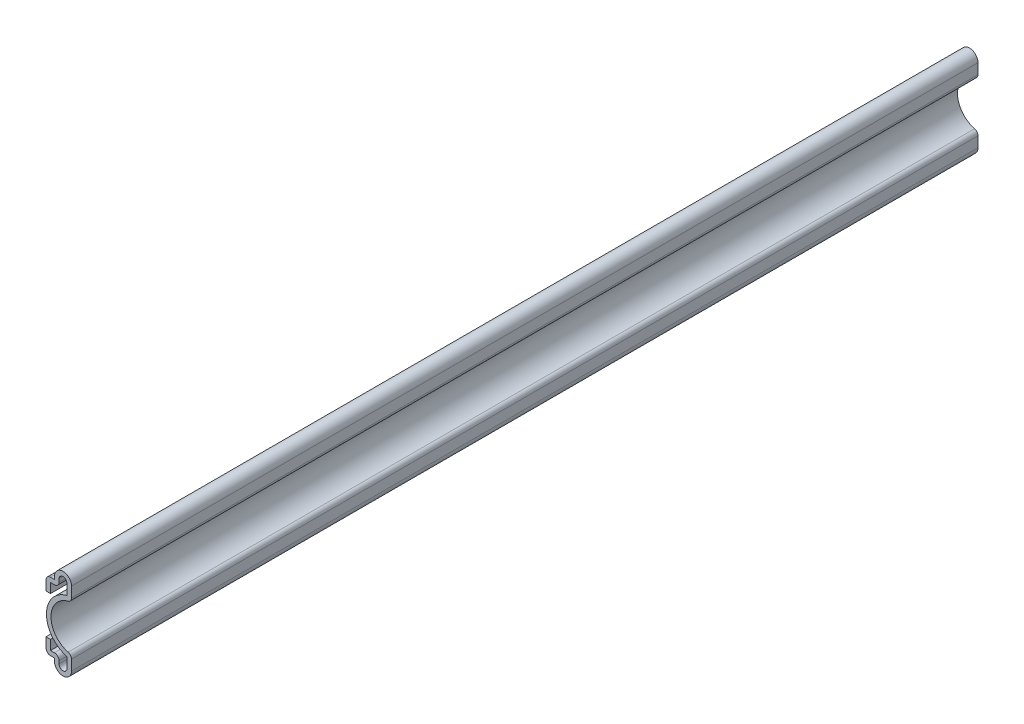
ISO-10303-21;
HEADER;
FILE_DESCRIPTION(('STEP AP214'),'2;1');
FILE_NAME('part.step','',(''),(''),'','','');
FILE_SCHEMA(('AUTOMOTIVE_DESIGN { 1 0 10303 214 1 1 1 1 }'));
ENDSEC;
DATA;
#1=APPLICATION_CONTEXT('core data for automotive mechanical design processes');
#2=APPLICATION_PROTOCOL_DEFINITION('international standard','automotive_design',2000,#1);
#3=PRODUCT_CONTEXT('',#1,'mechanical');
#4=PRODUCT('Part','Part','',(#3));
#5=PRODUCT_RELATED_PRODUCT_CATEGORY('part','',(#4));
#6=PRODUCT_DEFINITION_FORMATION('','',#4);
#7=PRODUCT_DEFINITION_CONTEXT('part definition',#1,'design');
#8=PRODUCT_DEFINITION('design','',#6,#7);
#9=PRODUCT_DEFINITION_SHAPE('','',#8);
#10=(LENGTH_UNIT() NAMED_UNIT(*) SI_UNIT(.MILLI.,.METRE.));
#11=(NAMED_UNIT(*) PLANE_ANGLE_UNIT() SI_UNIT($,.RADIAN.));
#12=(NAMED_UNIT(*) SI_UNIT($,.STERADIAN.) SOLID_ANGLE_UNIT());
#13=UNCERTAINTY_MEASURE_WITH_UNIT(LENGTH_MEASURE(1.E-05),#10,'distance_accuracy_value','');
#14=(GEOMETRIC_REPRESENTATION_CONTEXT(3) GLOBAL_UNCERTAINTY_ASSIGNED_CONTEXT((#13)) GLOBAL_UNIT_ASSIGNED_CONTEXT((#10,
#11,#12)) REPRESENTATION_CONTEXT('',''));
#15=CARTESIAN_POINT('',(0.,0.,0.));
#16=DIRECTION('',(0.,0.,1.));
#17=DIRECTION('',(1.,0.,0.));
#18=AXIS2_PLACEMENT_3D('',#15,#16,#17);
#19=CARTESIAN_POINT('',(-5.87375,7.14375,-254.));
#20=DIRECTION('',(1.,0.,0.));
#21=DIRECTION('',(0.,1.,0.));
#22=AXIS2_PLACEMENT_3D('',#19,#20,#21);
#23=PLANE('',#22);
#24=DIRECTION('',(0.,1.,0.));
#25=VECTOR('',#24,1.);
#26=CARTESIAN_POINT('',(-5.87375,7.14375,0.));
#27=LINE('',#26,#25);
#28=CARTESIAN_POINT('',(-5.87375,4.445,0.));
#29=VERTEX_POINT('',#28);
#30=CARTESIAN_POINT('',(-5.87375,7.14375,0.));
#31=VERTEX_POINT('',#30);
#32=EDGE_CURVE('E315',#29,#31,#27,.T.);
#33=ORIENTED_EDGE('',*,*,#32,.F.);
#34=DIRECTION('',(0.,0.,1.));
#35=VECTOR('',#34,1.);
#36=CARTESIAN_POINT('',(-5.87375,4.445,-254.));
#37=LINE('',#36,#35);
#38=CARTESIAN_POINT('',(-5.87375,4.445,-254.));
#39=VERTEX_POINT('',#38);
#40=EDGE_CURVE('E257',#39,#29,#37,.T.);
#41=ORIENTED_EDGE('',*,*,#40,.F.);
#42=DIRECTION('',(0.,1.,0.));
#43=VECTOR('',#42,1.);
#44=CARTESIAN_POINT('',(-5.87375,7.14375,-254.));
#45=LINE('',#44,#43);
#46=CARTESIAN_POINT('',(-5.87375,7.14375,-254.));
#47=VERTEX_POINT('',#46);
#48=EDGE_CURVE('E238',#39,#47,#45,.T.);
#49=ORIENTED_EDGE('',*,*,#48,.T.);
#50=DIRECTION('',(0.,0.,1.));
#51=VECTOR('',#50,1.);
#52=CARTESIAN_POINT('',(-5.87375,7.14375,-254.));
#53=LINE('',#52,#51);
#54=EDGE_CURVE('E245',#47,#31,#53,.T.);
#55=ORIENTED_EDGE('',*,*,#54,.T.);
#56=EDGE_LOOP('',(#33,#41,#49,#55));
#57=FACE_BOUND('',#56,.T.);
#58=ADVANCED_FACE('F35',(#57),#23,.T.);
#59=CARTESIAN_POINT('',(-7.14375,4.445,-254.));
#60=DIRECTION('',(0.,1.,0.));
#61=DIRECTION('',(-1.,0.,0.));
#62=AXIS2_PLACEMENT_3D('',#59,#60,#61);
#63=PLANE('',#62);
#64=DIRECTION('',(-1.,0.,0.));
#65=VECTOR('',#64,1.);
#66=CARTESIAN_POINT('',(-7.14375,4.445,0.));
#67=LINE('',#66,#65);
#68=CARTESIAN_POINT('',(-4.7625,4.445,0.));
#69=VERTEX_POINT('',#68);
#70=EDGE_CURVE('E258',#69,#29,#67,.T.);
#71=ORIENTED_EDGE('',*,*,#70,.F.);
#72=DIRECTION('',(0.,0.,1.));
#73=VECTOR('',#72,1.);
#74=CARTESIAN_POINT('',(-4.7625,4.445,-254.));
#75=LINE('',#74,#73);
#76=CARTESIAN_POINT('',(-4.7625,4.445,-254.));
#77=VERTEX_POINT('',#76);
#78=EDGE_CURVE('E450',#69,#77,#75,.F.);
#79=ORIENTED_EDGE('',*,*,#78,.T.);
#80=DIRECTION('',(-1.,0.,0.));
#81=VECTOR('',#80,1.);
#82=CARTESIAN_POINT('',(-7.14375,4.445,-254.));
#83=LINE('',#82,#81);
#84=EDGE_CURVE('E253',#77,#39,#83,.T.);
#85=ORIENTED_EDGE('',*,*,#84,.T.);
#86=ORIENTED_EDGE('',*,*,#40,.T.);
#87=EDGE_LOOP('',(#71,#79,#85,#86));
#88=FACE_BOUND('',#87,.T.);
#89=ADVANCED_FACE('F539',(#88),#63,.T.);
#90=CARTESIAN_POINT('',(-3.4925,3.17500000000001,-254.));
#91=DIRECTION('',(1.,0.,0.));
#92=DIRECTION('',(0.,1.,0.));
#93=AXIS2_PLACEMENT_3D('',#90,#91,#92);
#94=PLANE('',#93);
#95=DIRECTION('',(0.,1.,0.));
#96=VECTOR('',#95,1.);
#97=CARTESIAN_POINT('',(-3.4925,3.17500000000001,-254.));
#98=LINE('',#97,#96);
#99=CARTESIAN_POINT('',(-3.4925,2.38125000000001,-254.));
#100=VERTEX_POINT('',#99);
#101=CARTESIAN_POINT('',(-3.4925,3.17500000000001,-254.));
#102=VERTEX_POINT('',#101);
#103=EDGE_CURVE('E311',#100,#102,#98,.T.);
#104=ORIENTED_EDGE('',*,*,#103,.T.);
#105=DIRECTION('',(0.,0.,1.));
#106=VECTOR('',#105,1.);
#107=CARTESIAN_POINT('',(-3.4925,3.17500000000001,-254.));
#108=LINE('',#107,#106);
#109=CARTESIAN_POINT('',(-3.4925,3.17500000000001,0.));
#110=VERTEX_POINT('',#109);
#111=EDGE_CURVE('E447',#102,#110,#108,.T.);
#112=ORIENTED_EDGE('',*,*,#111,.T.);
#113=DIRECTION('',(0.,1.,0.));
#114=VECTOR('',#113,1.);
#115=CARTESIAN_POINT('',(-3.4925,3.17500000000001,0.));
#116=LINE('',#115,#114);
#117=CARTESIAN_POINT('',(-3.4925,2.38125000000001,0.));
#118=VERTEX_POINT('',#117);
#119=EDGE_CURVE('E260',#118,#110,#116,.T.);
#120=ORIENTED_EDGE('',*,*,#119,.F.);
#121=DIRECTION('',(0.,0.,1.));
#122=VECTOR('',#121,1.);
#123=CARTESIAN_POINT('',(-3.4925,2.38125000000001,-254.));
#124=LINE('',#123,#122);
#125=EDGE_CURVE('E372',#100,#118,#124,.T.);
#126=ORIENTED_EDGE('',*,*,#125,.F.);
#127=EDGE_LOOP('',(#104,#112,#120,#126));
#128=FACE_BOUND('',#127,.T.);
#129=ADVANCED_FACE('F531',(#128),#94,.T.);
#130=CARTESIAN_POINT('',(-2.38125,2.38125,-254.));
#131=DIRECTION('',(0.,0.,1.));
#132=DIRECTION('',(1.,0.,0.));
#133=AXIS2_PLACEMENT_3D('',#130,#131,#132);
#134=CYLINDRICAL_SURFACE('',#133,1.11125);
#135=CARTESIAN_POINT('',(-2.38125,2.38125,0.));
#136=DIRECTION('',(0.,0.,1.));
#137=DIRECTION('',(1.,0.,0.));
#138=AXIS2_PLACEMENT_3D('',#135,#136,#137);
#139=CIRCLE('',#138,1.11125);
#140=CARTESIAN_POINT('',(-1.27,2.38125,0.));
#141=VERTEX_POINT('',#140);
#142=EDGE_CURVE('E365',#141,#118,#139,.F.);
#143=ORIENTED_EDGE('',*,*,#142,.F.);
#144=DIRECTION('',(0.,0.,1.));
#145=VECTOR('',#144,1.);
#146=CARTESIAN_POINT('',(-1.27,2.38125,-254.));
#147=LINE('',#146,#145);
#148=CARTESIAN_POINT('',(-1.27,2.38125,-254.));
#149=VERTEX_POINT('',#148);
#150=EDGE_CURVE('E374',#149,#141,#147,.T.);
#151=ORIENTED_EDGE('',*,*,#150,.F.);
#152=CARTESIAN_POINT('',(-2.38125,2.38125,-254.));
#153=DIRECTION('',(0.,0.,1.));
#154=DIRECTION('',(1.,0.,0.));
#155=AXIS2_PLACEMENT_3D('',#152,#153,#154);
#156=CIRCLE('',#155,1.11125);
#157=EDGE_CURVE('E308',#149,#100,#156,.F.);
#158=ORIENTED_EDGE('',*,*,#157,.T.);
#159=ORIENTED_EDGE('',*,*,#125,.T.);
#160=EDGE_LOOP('',(#143,#151,#158,#159));
#161=FACE_BOUND('',#160,.T.);
#162=ADVANCED_FACE('F527',(#161),#134,.F.);
#163=CARTESIAN_POINT('',(-1.27,2.38125,-254.));
#164=DIRECTION('',(-1.,0.,0.));
#165=DIRECTION('',(0.,0.,1.));
#166=AXIS2_PLACEMENT_3D('',#163,#164,#165);
#167=PLANE('',#166);
#168=DIRECTION('',(0.,1.,0.));
#169=VECTOR('',#168,1.);
#170=CARTESIAN_POINT('',(-1.27,2.38125,0.));
#171=LINE('',#170,#169);
#172=CARTESIAN_POINT('',(-1.27,5.28924801386526,0.));
#173=VERTEX_POINT('',#172);
#174=EDGE_CURVE('E362',#173,#141,#171,.F.);
#175=ORIENTED_EDGE('',*,*,#174,.F.);
#176=DIRECTION('',(0.,0.,1.));
#177=VECTOR('',#176,1.);
#178=CARTESIAN_POINT('',(-1.27,5.28924801386526,-254.));
#179=LINE('',#178,#177);
#180=CARTESIAN_POINT('',(-1.27,5.28924801386526,-254.));
#181=VERTEX_POINT('',#180);
#182=EDGE_CURVE('E376',#181,#173,#179,.T.);
#183=ORIENTED_EDGE('',*,*,#182,.F.);
#184=DIRECTION('',(0.,1.,0.));
#185=VECTOR('',#184,1.);
#186=CARTESIAN_POINT('',(-1.27,2.38125,-254.));
#187=LINE('',#186,#185);
#188=EDGE_CURVE('E305',#181,#149,#187,.F.);
#189=ORIENTED_EDGE('',*,*,#188,.T.);
#190=ORIENTED_EDGE('',*,*,#150,.T.);
#191=EDGE_LOOP('',(#175,#183,#189,#190));
#192=FACE_BOUND('',#191,.T.);
#193=ADVANCED_FACE('F523',(#192),#167,.T.);
#194=CARTESIAN_POINT('',(0.634912292817671,12.7,-254.));
#195=DIRECTION('',(0.,0.,1.));
#196=DIRECTION('',(1.,0.,0.));
#197=AXIS2_PLACEMENT_3D('',#194,#195,#196);
#198=CYLINDRICAL_SURFACE('',#197,7.65166229281768);
#199=CARTESIAN_POINT('',(0.634912292817671,12.7,0.));
#200=DIRECTION('',(0.,0.,1.));
#201=DIRECTION('',(1.,0.,0.));
#202=AXIS2_PLACEMENT_3D('',#199,#200,#201);
#203=CIRCLE('',#202,7.65166229281768);
#204=CARTESIAN_POINT('',(-1.27,20.1107519861347,0.));
#205=VERTEX_POINT('',#204);
#206=EDGE_CURVE('E359',#205,#173,#203,.T.);
#207=ORIENTED_EDGE('',*,*,#206,.F.);
#208=DIRECTION('',(0.,0.,1.));
#209=VECTOR('',#208,1.);
#210=CARTESIAN_POINT('',(-1.27,20.1107519861347,-254.));
#211=LINE('',#210,#209);
#212=CARTESIAN_POINT('',(-1.27,20.1107519861347,-254.));
#213=VERTEX_POINT('',#212);
#214=EDGE_CURVE('E378',#213,#205,#211,.T.);
#215=ORIENTED_EDGE('',*,*,#214,.F.);
#216=CARTESIAN_POINT('',(0.634912292817671,12.7,-254.));
#217=DIRECTION('',(0.,0.,1.));
#218=DIRECTION('',(1.,0.,0.));
#219=AXIS2_PLACEMENT_3D('',#216,#217,#218);
#220=CIRCLE('',#219,7.65166229281768);
#221=EDGE_CURVE('E302',#213,#181,#220,.T.);
#222=ORIENTED_EDGE('',*,*,#221,.T.);
#223=ORIENTED_EDGE('',*,*,#182,.T.);
#224=EDGE_LOOP('',(#207,#215,#222,#223));
#225=FACE_BOUND('',#224,.T.);
#226=ADVANCED_FACE('F519',(#225),#198,.T.);
#227=CARTESIAN_POINT('',(-1.27,23.01875,-254.));
#228=DIRECTION('',(-1.,0.,0.));
#229=DIRECTION('',(0.,0.,1.));
#230=AXIS2_PLACEMENT_3D('',#227,#228,#229);
#231=PLANE('',#230);
#232=DIRECTION('',(0.,1.,0.));
#233=VECTOR('',#232,1.);
#234=CARTESIAN_POINT('',(-1.27,23.01875,0.));
#235=LINE('',#234,#233);
#236=CARTESIAN_POINT('',(-1.27,23.01875,0.));
#237=VERTEX_POINT('',#236);
#238=EDGE_CURVE('E356',#237,#205,#235,.F.);
#239=ORIENTED_EDGE('',*,*,#238,.F.);
#240=DIRECTION('',(0.,0.,1.));
#241=VECTOR('',#240,1.);
#242=CARTESIAN_POINT('',(-1.27,23.01875,-254.));
#243=LINE('',#242,#241);
#244=CARTESIAN_POINT('',(-1.27,23.01875,-254.));
#245=VERTEX_POINT('',#244);
#246=EDGE_CURVE('E380',#245,#237,#243,.T.);
#247=ORIENTED_EDGE('',*,*,#246,.F.);
#248=DIRECTION('',(0.,1.,0.));
#249=VECTOR('',#248,1.);
#250=CARTESIAN_POINT('',(-1.27,23.01875,-254.));
#251=LINE('',#250,#249);
#252=EDGE_CURVE('E299',#245,#213,#251,.F.);
#253=ORIENTED_EDGE('',*,*,#252,.T.);
#254=ORIENTED_EDGE('',*,*,#214,.T.);
#255=EDGE_LOOP('',(#239,#247,#253,#254));
#256=FACE_BOUND('',#255,.T.);
#257=ADVANCED_FACE('F516',(#256),#231,.T.);
#258=CARTESIAN_POINT('',(-2.38125,23.01875,-254.));
#259=DIRECTION('',(0.,0.,1.));
#260=DIRECTION('',(1.,0.,0.));
#261=AXIS2_PLACEMENT_3D('',#258,#259,#260);
#262=CYLINDRICAL_SURFACE('',#261,1.11125);
#263=CARTESIAN_POINT('',(-2.38125,23.01875,0.));
#264=DIRECTION('',(0.,0.,1.));
#265=DIRECTION('',(1.,0.,0.));
#266=AXIS2_PLACEMENT_3D('',#263,#264,#265);
#267=CIRCLE('',#266,1.11125);
#268=CARTESIAN_POINT('',(-3.4925,23.01875,0.));
#269=VERTEX_POINT('',#268);
#270=EDGE_CURVE('E353',#269,#237,#267,.F.);
#271=ORIENTED_EDGE('',*,*,#270,.F.);
#272=DIRECTION('',(0.,0.,1.));
#273=VECTOR('',#272,1.);
#274=CARTESIAN_POINT('',(-3.4925,23.01875,-254.));
#275=LINE('',#274,#273);
#276=CARTESIAN_POINT('',(-3.4925,23.01875,-254.));
#277=VERTEX_POINT('',#276);
#278=EDGE_CURVE('E382',#277,#269,#275,.T.);
#279=ORIENTED_EDGE('',*,*,#278,.F.);
#280=CARTESIAN_POINT('',(-2.38125,23.01875,-254.));
#281=DIRECTION('',(0.,0.,1.));
#282=DIRECTION('',(1.,0.,0.));
#283=AXIS2_PLACEMENT_3D('',#280,#281,#282);
#284=CIRCLE('',#283,1.11125);
#285=EDGE_CURVE('E296',#277,#245,#284,.F.);
#286=ORIENTED_EDGE('',*,*,#285,.T.);
#287=ORIENTED_EDGE('',*,*,#246,.T.);
#288=EDGE_LOOP('',(#271,#279,#286,#287));
#289=FACE_BOUND('',#288,.T.);
#290=ADVANCED_FACE('F512',(#289),#262,.F.);
#291=CARTESIAN_POINT('',(-3.4925,22.225,-254.));
#292=DIRECTION('',(1.,0.,0.));
#293=DIRECTION('',(0.,1.,0.));
#294=AXIS2_PLACEMENT_3D('',#291,#292,#293);
#295=PLANE('',#294);
#296=DIRECTION('',(0.,1.,0.));
#297=VECTOR('',#296,1.);
#298=CARTESIAN_POINT('',(-3.4925,22.225,0.));
#299=LINE('',#298,#297);
#300=CARTESIAN_POINT('',(-3.4925,22.225,0.));
#301=VERTEX_POINT('',#300);
#302=EDGE_CURVE('E351',#301,#269,#299,.T.);
#303=ORIENTED_EDGE('',*,*,#302,.F.);
#304=DIRECTION('',(0.,0.,1.));
#305=VECTOR('',#304,1.);
#306=CARTESIAN_POINT('',(-3.4925,22.225,-254.));
#307=LINE('',#306,#305);
#308=CARTESIAN_POINT('',(-3.4925,22.225,-254.));
#309=VERTEX_POINT('',#308);
#310=EDGE_CURVE('E455',#301,#309,#307,.F.);
#311=ORIENTED_EDGE('',*,*,#310,.T.);
#312=DIRECTION('',(0.,1.,0.));
#313=VECTOR('',#312,1.);
#314=CARTESIAN_POINT('',(-3.4925,22.225,-254.));
#315=LINE('',#314,#313);
#316=EDGE_CURVE('E294',#309,#277,#315,.T.);
#317=ORIENTED_EDGE('',*,*,#316,.T.);
#318=ORIENTED_EDGE('',*,*,#278,.T.);
#319=EDGE_LOOP('',(#303,#311,#317,#318));
#320=FACE_BOUND('',#319,.T.);
#321=ADVANCED_FACE('F503',(#320),#295,.T.);
#322=CARTESIAN_POINT('',(-7.14375,20.955,-254.));
#323=DIRECTION('',(0.,-1.,0.));
#324=DIRECTION('',(0.,0.,-1.));
#325=AXIS2_PLACEMENT_3D('',#322,#323,#324);
#326=PLANE('',#325);
#327=DIRECTION('',(1.,0.,0.));
#328=VECTOR('',#327,1.);
#329=CARTESIAN_POINT('',(-7.14375,20.955,-254.));
#330=LINE('',#329,#328);
#331=CARTESIAN_POINT('',(-5.87375,20.955,-254.));
#332=VERTEX_POINT('',#331);
#333=CARTESIAN_POINT('',(-4.7625,20.955,-254.));
#334=VERTEX_POINT('',#333);
#335=EDGE_CURVE('E291',#332,#334,#330,.T.);
#336=ORIENTED_EDGE('',*,*,#335,.T.);
#337=DIRECTION('',(0.,0.,1.));
#338=VECTOR('',#337,1.);
#339=CARTESIAN_POINT('',(-4.7625,20.955,-254.));
#340=LINE('',#339,#338);
#341=CARTESIAN_POINT('',(-4.7625,20.955,0.));
#342=VERTEX_POINT('',#341);
#343=EDGE_CURVE('E452',#334,#342,#340,.T.);
#344=ORIENTED_EDGE('',*,*,#343,.T.);
#345=DIRECTION('',(1.,0.,0.));
#346=VECTOR('',#345,1.);
#347=CARTESIAN_POINT('',(-7.14375,20.955,0.));
#348=LINE('',#347,#346);
#349=CARTESIAN_POINT('',(-5.87375,20.955,0.));
#350=VERTEX_POINT('',#349);
#351=EDGE_CURVE('E348',#350,#342,#348,.T.);
#352=ORIENTED_EDGE('',*,*,#351,.F.);
#353=DIRECTION('',(0.,0.,1.));
#354=VECTOR('',#353,1.);
#355=CARTESIAN_POINT('',(-5.87375,20.955,-254.));
#356=LINE('',#355,#354);
#357=EDGE_CURVE('E385',#332,#350,#356,.T.);
#358=ORIENTED_EDGE('',*,*,#357,.F.);
#359=EDGE_LOOP('',(#336,#344,#352,#358));
#360=FACE_BOUND('',#359,.T.);
#361=ADVANCED_FACE('F497',(#360),#326,.T.);
#362=CARTESIAN_POINT('',(-5.87375,18.25625,-254.));
#363=DIRECTION('',(1.,0.,0.));
#364=DIRECTION('',(0.,1.,0.));
#365=AXIS2_PLACEMENT_3D('',#362,#363,#364);
#366=PLANE('',#365);
#367=DIRECTION('',(0.,1.,0.));
#368=VECTOR('',#367,1.);
#369=CARTESIAN_POINT('',(-5.87375,18.25625,0.));
#370=LINE('',#369,#368);
#371=CARTESIAN_POINT('',(-5.87375,18.25625,0.));
#372=VERTEX_POINT('',#371);
#373=EDGE_CURVE('E345',#372,#350,#370,.T.);
#374=ORIENTED_EDGE('',*,*,#373,.F.);
#375=DIRECTION('',(0.,0.,1.));
#376=VECTOR('',#375,1.);
#377=CARTESIAN_POINT('',(-5.87375,18.25625,-254.));
#378=LINE('',#377,#376);
#379=CARTESIAN_POINT('',(-5.87375,18.25625,-254.));
#380=VERTEX_POINT('',#379);
#381=EDGE_CURVE('E387',#380,#372,#378,.T.);
#382=ORIENTED_EDGE('',*,*,#381,.F.);
#383=DIRECTION('',(0.,1.,0.));
#384=VECTOR('',#383,1.);
#385=CARTESIAN_POINT('',(-5.87375,18.25625,-254.));
#386=LINE('',#385,#384);
#387=EDGE_CURVE('E288',#380,#332,#386,.T.);
#388=ORIENTED_EDGE('',*,*,#387,.T.);
#389=ORIENTED_EDGE('',*,*,#357,.T.);
#390=EDGE_LOOP('',(#374,#382,#388,#389));
#391=FACE_BOUND('',#390,.T.);
#392=ADVANCED_FACE('F491',(#391),#366,.T.);
#393=CARTESIAN_POINT('',(-5.87375,18.25625,-254.));
#394=DIRECTION('',(0.,1.,0.));
#395=DIRECTION('',(0.,0.,1.));
#396=AXIS2_PLACEMENT_3D('',#393,#394,#395);
#397=PLANE('',#396);
#398=DIRECTION('',(-1.,0.,0.));
#399=VECTOR('',#398,1.);
#400=CARTESIAN_POINT('',(-5.87375,18.25625,0.));
#401=LINE('',#400,#399);
#402=CARTESIAN_POINT('',(-7.14375000000001,18.25625,0.));
#403=VERTEX_POINT('',#402);
#404=EDGE_CURVE('E343',#372,#403,#401,.T.);
#405=ORIENTED_EDGE('',*,*,#404,.T.);
#406=DIRECTION('',(0.,0.,1.));
#407=VECTOR('',#406,1.);
#408=CARTESIAN_POINT('',(-7.14375000000001,18.25625,-254.));
#409=LINE('',#408,#407);
#410=CARTESIAN_POINT('',(-7.14375000000001,18.25625,-254.));
#411=VERTEX_POINT('',#410);
#412=EDGE_CURVE('E389',#411,#403,#409,.T.);
#413=ORIENTED_EDGE('',*,*,#412,.F.);
#414=DIRECTION('',(-1.,0.,0.));
#415=VECTOR('',#414,1.);
#416=CARTESIAN_POINT('',(-5.87375,18.25625,-254.));
#417=LINE('',#416,#415);
#418=EDGE_CURVE('E286',#380,#411,#417,.T.);
#419=ORIENTED_EDGE('',*,*,#418,.F.);
#420=ORIENTED_EDGE('',*,*,#381,.T.);
#421=EDGE_LOOP('',(#405,#413,#419,#420));
#422=FACE_BOUND('',#421,.T.);
#423=ADVANCED_FACE('F623',(#422),#397,.F.);
#424=CARTESIAN_POINT('',(-7.14375000000001,18.25625,-254.));
#425=DIRECTION('',(1.,0.,0.));
#426=DIRECTION('',(0.,1.,0.));
#427=AXIS2_PLACEMENT_3D('',#424,#425,#426);
#428=PLANE('',#427);
#429=DIRECTION('',(0.,1.,0.));
#430=VECTOR('',#429,1.);
#431=CARTESIAN_POINT('',(-7.14375000000001,18.25625,0.));
#432=LINE('',#431,#430);
#433=CARTESIAN_POINT('',(-7.14375,20.955,0.));
#434=VERTEX_POINT('',#433);
#435=EDGE_CURVE('E340',#403,#434,#432,.T.);
#436=ORIENTED_EDGE('',*,*,#435,.T.);
#437=DIRECTION('',(0.,0.,1.));
#438=VECTOR('',#437,1.);
#439=CARTESIAN_POINT('',(-7.14375,20.955,-254.));
#440=LINE('',#439,#438);
#441=CARTESIAN_POINT('',(-7.14375,20.955,-254.));
#442=VERTEX_POINT('',#441);
#443=EDGE_CURVE('E11',#434,#442,#440,.F.);
#444=ORIENTED_EDGE('',*,*,#443,.T.);
#445=DIRECTION('',(0.,1.,0.));
#446=VECTOR('',#445,1.);
#447=CARTESIAN_POINT('',(-7.14375000000001,18.25625,-254.));
#448=LINE('',#447,#446);
#449=EDGE_CURVE('E283',#411,#442,#448,.T.);
#450=ORIENTED_EDGE('',*,*,#449,.F.);
#451=ORIENTED_EDGE('',*,*,#412,.T.);
#452=EDGE_LOOP('',(#436,#444,#450,#451));
#453=FACE_BOUND('',#452,.T.);
#454=ADVANCED_FACE('F485',(#453),#428,.F.);
#455=CARTESIAN_POINT('',(-7.14375,22.225,-254.));
#456=DIRECTION('',(0.,-1.,0.));
#457=DIRECTION('',(0.,0.,-1.));
#458=AXIS2_PLACEMENT_3D('',#455,#456,#457);
#459=PLANE('',#458);
#460=DIRECTION('',(1.,0.,0.));
#461=VECTOR('',#460,1.);
#462=CARTESIAN_POINT('',(-7.14375,22.225,-254.));
#463=LINE('',#462,#461);
#464=CARTESIAN_POINT('',(-5.87375,22.225,-254.));
#465=VERTEX_POINT('',#464);
#466=CARTESIAN_POINT('',(-4.7625,22.225,-254.));
#467=VERTEX_POINT('',#466);
#468=EDGE_CURVE('E281',#465,#467,#463,.T.);
#469=ORIENTED_EDGE('',*,*,#468,.F.);
#470=DIRECTION('',(0.,0.,1.));
#471=VECTOR('',#470,1.);
#472=CARTESIAN_POINT('',(-5.87375,22.225,-254.));
#473=LINE('',#472,#471);
#474=CARTESIAN_POINT('',(-5.87375,22.225,0.));
#475=VERTEX_POINT('',#474);
#476=EDGE_CURVE('E43',#465,#475,#473,.T.);
#477=ORIENTED_EDGE('',*,*,#476,.T.);
#478=DIRECTION('',(1.,0.,0.));
#479=VECTOR('',#478,1.);
#480=CARTESIAN_POINT('',(-7.14375,22.225,0.));
#481=LINE('',#480,#479);
#482=CARTESIAN_POINT('',(-4.7625,22.225,0.));
#483=VERTEX_POINT('',#482);
#484=EDGE_CURVE('E338',#475,#483,#481,.T.);
#485=ORIENTED_EDGE('',*,*,#484,.T.);
#486=DIRECTION('',(0.,0.,1.));
#487=VECTOR('',#486,1.);
#488=CARTESIAN_POINT('',(-4.7625,22.225,-254.));
#489=LINE('',#488,#487);
#490=EDGE_CURVE('E392',#467,#483,#489,.T.);
#491=ORIENTED_EDGE('',*,*,#490,.F.);
#492=EDGE_LOOP('',(#469,#477,#485,#491));
#493=FACE_BOUND('',#492,.T.);
#494=ADVANCED_FACE('F461',(#493),#459,.F.);
#495=CARTESIAN_POINT('',(-4.7625,22.225,-254.));
#496=DIRECTION('',(1.,0.,0.));
#497=DIRECTION('',(0.,1.,0.));
#498=AXIS2_PLACEMENT_3D('',#495,#496,#497);
#499=PLANE('',#498);
#500=DIRECTION('',(0.,1.,0.));
#501=VECTOR('',#500,1.);
#502=CARTESIAN_POINT('',(-4.7625,22.225,0.));
#503=LINE('',#502,#501);
#504=CARTESIAN_POINT('',(-4.7625,23.01875,0.));
#505=VERTEX_POINT('',#504);
#506=EDGE_CURVE('E336',#483,#505,#503,.T.);
#507=ORIENTED_EDGE('',*,*,#506,.T.);
#508=DIRECTION('',(0.,0.,1.));
#509=VECTOR('',#508,1.);
#510=CARTESIAN_POINT('',(-4.7625,23.01875,-254.));
#511=LINE('',#510,#509);
#512=CARTESIAN_POINT('',(-4.7625,23.01875,-254.));
#513=VERTEX_POINT('',#512);
#514=EDGE_CURVE('E395',#513,#505,#511,.T.);
#515=ORIENTED_EDGE('',*,*,#514,.F.);
#516=DIRECTION('',(0.,1.,0.));
#517=VECTOR('',#516,1.);
#518=CARTESIAN_POINT('',(-4.7625,22.225,-254.));
#519=LINE('',#518,#517);
#520=EDGE_CURVE('E279',#467,#513,#519,.T.);
#521=ORIENTED_EDGE('',*,*,#520,.F.);
#522=ORIENTED_EDGE('',*,*,#490,.T.);
#523=EDGE_LOOP('',(#507,#515,#521,#522));
#524=FACE_BOUND('',#523,.T.);
#525=ADVANCED_FACE('F474',(#524),#499,.F.);
#526=CARTESIAN_POINT('',(-2.38125,23.01875,-254.));
#527=DIRECTION('',(0.,0.,1.));
#528=DIRECTION('',(1.,0.,0.));
#529=AXIS2_PLACEMENT_3D('',#526,#527,#528);
#530=CYLINDRICAL_SURFACE('',#529,2.38125);
#531=CARTESIAN_POINT('',(-2.38125,23.01875,0.));
#532=DIRECTION('',(0.,0.,-1.));
#533=DIRECTION('',(-1.,0.,0.));
#534=AXIS2_PLACEMENT_3D('',#531,#532,#533);
#535=CIRCLE('',#534,2.38125);
#536=CARTESIAN_POINT('',(0.,23.01875,0.));
#537=VERTEX_POINT('',#536);
#538=EDGE_CURVE('E334',#505,#537,#535,.T.);
#539=ORIENTED_EDGE('',*,*,#538,.T.);
#540=DIRECTION('',(0.,0.,1.));
#541=VECTOR('',#540,1.);
#542=CARTESIAN_POINT('',(0.,23.01875,-254.));
#543=LINE('',#542,#541);
#544=CARTESIAN_POINT('',(0.,23.01875,-254.));
#545=VERTEX_POINT('',#544);
#546=EDGE_CURVE('E398',#545,#537,#543,.T.);
#547=ORIENTED_EDGE('',*,*,#546,.F.);
#548=CARTESIAN_POINT('',(-2.38125,23.01875,-254.));
#549=DIRECTION('',(0.,0.,-1.));
#550=DIRECTION('',(-1.,0.,0.));
#551=AXIS2_PLACEMENT_3D('',#548,#549,#550);
#552=CIRCLE('',#551,2.38125);
#553=EDGE_CURVE('E277',#513,#545,#552,.T.);
#554=ORIENTED_EDGE('',*,*,#553,.F.);
#555=ORIENTED_EDGE('',*,*,#514,.T.);
#556=EDGE_LOOP('',(#539,#547,#554,#555));
#557=FACE_BOUND('',#556,.T.);
#558=ADVANCED_FACE('F478',(#557),#530,.T.);
#559=CARTESIAN_POINT('',(0.,23.01875,-254.));
#560=DIRECTION('',(-1.,0.,0.));
#561=DIRECTION('',(0.,0.,1.));
#562=AXIS2_PLACEMENT_3D('',#559,#560,#561);
#563=PLANE('',#562);
#564=DIRECTION('',(0.,-1.,0.));
#565=VECTOR('',#564,1.);
#566=CARTESIAN_POINT('',(0.,23.01875,0.));
#567=LINE('',#566,#565);
#568=CARTESIAN_POINT('',(0.,20.1107519861347,0.));
#569=VERTEX_POINT('',#568);
#570=EDGE_CURVE('E331',#537,#569,#567,.T.);
#571=ORIENTED_EDGE('',*,*,#570,.T.);
#572=DIRECTION('',(0.,0.,1.));
#573=VECTOR('',#572,1.);
#574=CARTESIAN_POINT('',(0.,20.1107519861347,-254.));
#575=LINE('',#574,#573);
#576=CARTESIAN_POINT('',(0.,20.1107519861347,-254.));
#577=VERTEX_POINT('',#576);
#578=EDGE_CURVE('E427',#569,#577,#575,.F.);
#579=ORIENTED_EDGE('',*,*,#578,.T.);
#580=DIRECTION('',(0.,-1.,0.));
#581=VECTOR('',#580,1.);
#582=CARTESIAN_POINT('',(0.,23.01875,-254.));
#583=LINE('',#582,#581);
#584=EDGE_CURVE('E275',#545,#577,#583,.T.);
#585=ORIENTED_EDGE('',*,*,#584,.F.);
#586=ORIENTED_EDGE('',*,*,#546,.T.);
#587=EDGE_LOOP('',(#571,#579,#585,#586));
#588=FACE_BOUND('',#587,.T.);
#589=ADVANCED_FACE('F611',(#588),#563,.F.);
#590=CARTESIAN_POINT('',(0.634912292817671,12.7,-254.));
#591=DIRECTION('',(0.,0.,1.));
#592=DIRECTION('',(1.,0.,0.));
#593=AXIS2_PLACEMENT_3D('',#590,#591,#592);
#594=CYLINDRICAL_SURFACE('',#593,6.38166229281768);
#595=CARTESIAN_POINT('',(0.634912292817671,12.7,-254.));
#596=DIRECTION('',(0.,0.,1.));
#597=DIRECTION('',(-1.,0.,0.));
#598=AXIS2_PLACEMENT_3D('',#595,#596,#597);
#599=CIRCLE('',#598,6.38166229281768);
#600=CARTESIAN_POINT('',(-0.953828360518564,18.8807375576065,-254.));
#601=VERTEX_POINT('',#600);
#602=CARTESIAN_POINT('',(-0.953828360518565,6.51926244239349,-254.));
#603=VERTEX_POINT('',#602);
#604=EDGE_CURVE('E272',#601,#603,#599,.T.);
#605=ORIENTED_EDGE('',*,*,#604,.F.);
#606=DIRECTION('',(0.,0.,1.));
#607=VECTOR('',#606,1.);
#608=CARTESIAN_POINT('',(-0.953828360518565,18.8807375576065,-254.));
#609=LINE('',#608,#607);
#610=CARTESIAN_POINT('',(-0.953828360518564,18.8807375576065,0.));
#611=VERTEX_POINT('',#610);
#612=EDGE_CURVE('E412',#601,#611,#609,.T.);
#613=ORIENTED_EDGE('',*,*,#612,.T.);
#614=CARTESIAN_POINT('',(0.634912292817671,12.7,0.));
#615=DIRECTION('',(0.,0.,1.));
#616=DIRECTION('',(-1.,0.,0.));
#617=AXIS2_PLACEMENT_3D('',#614,#615,#616);
#618=CIRCLE('',#617,6.38166229281768);
#619=CARTESIAN_POINT('',(-0.953828360518565,6.51926244239349,0.));
#620=VERTEX_POINT('',#619);
#621=EDGE_CURVE('E328',#611,#620,#618,.T.);
#622=ORIENTED_EDGE('',*,*,#621,.T.);
#623=DIRECTION('',(0.,0.,1.));
#624=VECTOR('',#623,1.);
#625=CARTESIAN_POINT('',(-0.953828360518565,6.51926244239348,-254.));
#626=LINE('',#625,#624);
#627=EDGE_CURVE('E371',#620,#603,#626,.F.);
#628=ORIENTED_EDGE('',*,*,#627,.T.);
#629=EDGE_LOOP('',(#605,#613,#622,#628));
#630=FACE_BOUND('',#629,.T.);
#631=ADVANCED_FACE('F578',(#630),#594,.F.);
#632=CARTESIAN_POINT('',(0.,2.38125,-254.));
#633=DIRECTION('',(-1.,0.,0.));
#634=DIRECTION('',(0.,0.,1.));
#635=AXIS2_PLACEMENT_3D('',#632,#633,#634);
#636=PLANE('',#635);
#637=DIRECTION('',(0.,-1.,0.));
#638=VECTOR('',#637,1.);
#639=CARTESIAN_POINT('',(0.,2.38125,-254.));
#640=LINE('',#639,#638);
#641=CARTESIAN_POINT('',(0.,5.28924801386526,-254.));
#642=VERTEX_POINT('',#641);
#643=CARTESIAN_POINT('',(0.,2.38125,-254.));
#644=VERTEX_POINT('',#643);
#645=EDGE_CURVE('E270',#642,#644,#640,.T.);
#646=ORIENTED_EDGE('',*,*,#645,.F.);
#647=DIRECTION('',(0.,0.,1.));
#648=VECTOR('',#647,1.);
#649=CARTESIAN_POINT('',(0.,5.28924801386526,-254.));
#650=LINE('',#649,#648);
#651=CARTESIAN_POINT('',(0.,5.28924801386526,0.));
#652=VERTEX_POINT('',#651);
#653=EDGE_CURVE('E440',#642,#652,#650,.T.);
#654=ORIENTED_EDGE('',*,*,#653,.T.);
#655=DIRECTION('',(0.,-1.,0.));
#656=VECTOR('',#655,1.);
#657=CARTESIAN_POINT('',(0.,2.38125,0.));
#658=LINE('',#657,#656);
#659=CARTESIAN_POINT('',(0.,2.38125,0.));
#660=VERTEX_POINT('',#659);
#661=EDGE_CURVE('E326',#652,#660,#658,.T.);
#662=ORIENTED_EDGE('',*,*,#661,.T.);
#663=DIRECTION('',(0.,0.,1.));
#664=VECTOR('',#663,1.);
#665=CARTESIAN_POINT('',(0.,2.38125,-254.));
#666=LINE('',#665,#664);
#667=EDGE_CURVE('E401',#644,#660,#666,.T.);
#668=ORIENTED_EDGE('',*,*,#667,.F.);
#669=EDGE_LOOP('',(#646,#654,#662,#668));
#670=FACE_BOUND('',#669,.T.);
#671=ADVANCED_FACE('F584',(#670),#636,.F.);
#672=CARTESIAN_POINT('',(-2.38125,2.38125,-254.));
#673=DIRECTION('',(0.,0.,1.));
#674=DIRECTION('',(1.,0.,0.));
#675=AXIS2_PLACEMENT_3D('',#672,#673,#674);
#676=CYLINDRICAL_SURFACE('',#675,2.38125);
#677=CARTESIAN_POINT('',(-2.38125,2.38125,0.));
#678=DIRECTION('',(0.,0.,-1.));
#679=DIRECTION('',(1.,0.,0.));
#680=AXIS2_PLACEMENT_3D('',#677,#678,#679);
#681=CIRCLE('',#680,2.38125);
#682=CARTESIAN_POINT('',(-4.7625,2.38125,0.));
#683=VERTEX_POINT('',#682);
#684=EDGE_CURVE('E324',#660,#683,#681,.T.);
#685=ORIENTED_EDGE('',*,*,#684,.T.);
#686=DIRECTION('',(0.,0.,1.));
#687=VECTOR('',#686,1.);
#688=CARTESIAN_POINT('',(-4.7625,2.38125,-254.));
#689=LINE('',#688,#687);
#690=CARTESIAN_POINT('',(-4.7625,2.38125,-254.));
#691=VERTEX_POINT('',#690);
#692=EDGE_CURVE('E404',#691,#683,#689,.T.);
#693=ORIENTED_EDGE('',*,*,#692,.F.);
#694=CARTESIAN_POINT('',(-2.38125,2.38125,-254.));
#695=DIRECTION('',(0.,0.,-1.));
#696=DIRECTION('',(1.,0.,0.));
#697=AXIS2_PLACEMENT_3D('',#694,#695,#696);
#698=CIRCLE('',#697,2.38125);
#699=EDGE_CURVE('E268',#644,#691,#698,.T.);
#700=ORIENTED_EDGE('',*,*,#699,.F.);
#701=ORIENTED_EDGE('',*,*,#667,.T.);
#702=EDGE_LOOP('',(#685,#693,#700,#701));
#703=FACE_BOUND('',#702,.T.);
#704=ADVANCED_FACE('F590',(#703),#676,.T.);
#705=CARTESIAN_POINT('',(-4.7625,3.175,-254.));
#706=DIRECTION('',(1.,0.,0.));
#707=DIRECTION('',(0.,1.,0.));
#708=AXIS2_PLACEMENT_3D('',#705,#706,#707);
#709=PLANE('',#708);
#710=DIRECTION('',(0.,1.,0.));
#711=VECTOR('',#710,1.);
#712=CARTESIAN_POINT('',(-4.7625,3.175,0.));
#713=LINE('',#712,#711);
#714=CARTESIAN_POINT('',(-4.7625,3.175,0.));
#715=VERTEX_POINT('',#714);
#716=EDGE_CURVE('E322',#683,#715,#713,.T.);
#717=ORIENTED_EDGE('',*,*,#716,.T.);
#718=DIRECTION('',(0.,0.,1.));
#719=VECTOR('',#718,1.);
#720=CARTESIAN_POINT('',(-4.7625,3.175,-254.));
#721=LINE('',#720,#719);
#722=CARTESIAN_POINT('',(-4.7625,3.175,-254.));
#723=VERTEX_POINT('',#722);
#724=EDGE_CURVE('E407',#723,#715,#721,.T.);
#725=ORIENTED_EDGE('',*,*,#724,.F.);
#726=DIRECTION('',(0.,1.,0.));
#727=VECTOR('',#726,1.);
#728=CARTESIAN_POINT('',(-4.7625,3.175,-254.));
#729=LINE('',#728,#727);
#730=EDGE_CURVE('E266',#691,#723,#729,.T.);
#731=ORIENTED_EDGE('',*,*,#730,.F.);
#732=ORIENTED_EDGE('',*,*,#692,.T.);
#733=EDGE_LOOP('',(#717,#725,#731,#732));
#734=FACE_BOUND('',#733,.T.);
#735=ADVANCED_FACE('F594',(#734),#709,.F.);
#736=CARTESIAN_POINT('',(-7.14375,3.175,-254.));
#737=DIRECTION('',(0.,1.,0.));
#738=DIRECTION('',(-1.,0.,0.));
#739=AXIS2_PLACEMENT_3D('',#736,#737,#738);
#740=PLANE('',#739);
#741=DIRECTION('',(-1.,0.,0.));
#742=VECTOR('',#741,1.);
#743=CARTESIAN_POINT('',(-7.14375,3.175,0.));
#744=LINE('',#743,#742);
#745=CARTESIAN_POINT('',(-5.87375,3.175,0.));
#746=VERTEX_POINT('',#745);
#747=EDGE_CURVE('E320',#715,#746,#744,.T.);
#748=ORIENTED_EDGE('',*,*,#747,.T.);
#749=DIRECTION('',(0.,0.,1.));
#750=VECTOR('',#749,1.);
#751=CARTESIAN_POINT('',(-5.87375,3.175,-254.));
#752=LINE('',#751,#750);
#753=CARTESIAN_POINT('',(-5.87375,3.175,-254.));
#754=VERTEX_POINT('',#753);
#755=EDGE_CURVE('E58',#746,#754,#752,.F.);
#756=ORIENTED_EDGE('',*,*,#755,.T.);
#757=DIRECTION('',(-1.,0.,0.));
#758=VECTOR('',#757,1.);
#759=CARTESIAN_POINT('',(-7.14375,3.175,-254.));
#760=LINE('',#759,#758);
#761=EDGE_CURVE('E264',#723,#754,#760,.T.);
#762=ORIENTED_EDGE('',*,*,#761,.F.);
#763=ORIENTED_EDGE('',*,*,#724,.T.);
#764=EDGE_LOOP('',(#748,#756,#762,#763));
#765=FACE_BOUND('',#764,.T.);
#766=ADVANCED_FACE('F596',(#765),#740,.F.);
#767=CARTESIAN_POINT('',(-7.14375000000001,7.14375,-254.));
#768=DIRECTION('',(1.,0.,0.));
#769=DIRECTION('',(0.,1.,0.));
#770=AXIS2_PLACEMENT_3D('',#767,#768,#769);
#771=PLANE('',#770);
#772=DIRECTION('',(0.,1.,0.));
#773=VECTOR('',#772,1.);
#774=CARTESIAN_POINT('',(-7.14375000000001,7.14375,-254.));
#775=LINE('',#774,#773);
#776=CARTESIAN_POINT('',(-7.14375,4.445,-254.));
#777=VERTEX_POINT('',#776);
#778=CARTESIAN_POINT('',(-7.14375000000001,7.14375,-254.));
#779=VERTEX_POINT('',#778);
#780=EDGE_CURVE('E239',#777,#779,#775,.T.);
#781=ORIENTED_EDGE('',*,*,#780,.F.);
#782=DIRECTION('',(0.,0.,1.));
#783=VECTOR('',#782,1.);
#784=CARTESIAN_POINT('',(-7.14375,4.445,-254.));
#785=LINE('',#784,#783);
#786=CARTESIAN_POINT('',(-7.14375,4.445,0.));
#787=VERTEX_POINT('',#786);
#788=EDGE_CURVE('E443',#777,#787,#785,.T.);
#789=ORIENTED_EDGE('',*,*,#788,.T.);
#790=DIRECTION('',(0.,1.,0.));
#791=VECTOR('',#790,1.);
#792=CARTESIAN_POINT('',(-7.14375000000001,7.14375,0.));
#793=LINE('',#792,#791);
#794=CARTESIAN_POINT('',(-7.14375000000001,7.14375,0.));
#795=VERTEX_POINT('',#794);
#796=EDGE_CURVE('E318',#787,#795,#793,.T.);
#797=ORIENTED_EDGE('',*,*,#796,.T.);
#798=DIRECTION('',(0.,0.,1.));
#799=VECTOR('',#798,1.);
#800=CARTESIAN_POINT('',(-7.14375000000001,7.14375,-254.));
#801=LINE('',#800,#799);
#802=EDGE_CURVE('E252',#779,#795,#801,.T.);
#803=ORIENTED_EDGE('',*,*,#802,.F.);
#804=EDGE_LOOP('',(#781,#789,#797,#803));
#805=FACE_BOUND('',#804,.T.);
#806=ADVANCED_FACE('F543',(#805),#771,.F.);
#807=CARTESIAN_POINT('',(-7.14375000000001,7.14375,-254.));
#808=DIRECTION('',(0.,-1.,0.));
#809=DIRECTION('',(0.,0.,-1.));
#810=AXIS2_PLACEMENT_3D('',#807,#808,#809);
#811=PLANE('',#810);
#812=DIRECTION('',(1.,0.,0.));
#813=VECTOR('',#812,1.);
#814=CARTESIAN_POINT('',(-7.14375000000001,7.14375,0.));
#815=LINE('',#814,#813);
#816=EDGE_CURVE('E248',#795,#31,#815,.T.);
#817=ORIENTED_EDGE('',*,*,#816,.T.);
#818=ORIENTED_EDGE('',*,*,#54,.F.);
#819=DIRECTION('',(1.,0.,0.));
#820=VECTOR('',#819,1.);
#821=CARTESIAN_POINT('',(-7.14375000000001,7.14375,-254.));
#822=LINE('',#821,#820);
#823=EDGE_CURVE('E232',#779,#47,#822,.T.);
#824=ORIENTED_EDGE('',*,*,#823,.F.);
#825=ORIENTED_EDGE('',*,*,#802,.T.);
#826=EDGE_LOOP('',(#817,#818,#824,#825));
#827=FACE_BOUND('',#826,.T.);
#828=ADVANCED_FACE('F246',(#827),#811,.F.);
#829=CARTESIAN_POINT('',(-2.38125,2.38125,-254.));
#830=DIRECTION('',(0.,0.,-1.));
#831=DIRECTION('',(-1.,0.,0.));
#832=AXIS2_PLACEMENT_3D('',#829,#830,#831);
#833=PLANE('',#832);
#834=ORIENTED_EDGE('',*,*,#584,.T.);
#835=CARTESIAN_POINT('',(-1.27,20.1107519861347,-254.));
#836=DIRECTION('',(0.,0.,-1.));
#837=DIRECTION('',(-1.,0.,0.));
#838=AXIS2_PLACEMENT_3D('',#835,#836,#837);
#839=CIRCLE('',#838,1.27);
#840=EDGE_CURVE('E438',#577,#601,#839,.T.);
#841=ORIENTED_EDGE('',*,*,#840,.T.);
#842=ORIENTED_EDGE('',*,*,#604,.T.);
#843=CARTESIAN_POINT('',(-1.27,5.28924801386526,-254.));
#844=DIRECTION('',(0.,0.,-1.));
#845=DIRECTION('',(-1.,0.,0.));
#846=AXIS2_PLACEMENT_3D('',#843,#844,#845);
#847=CIRCLE('',#846,1.27);
#848=EDGE_CURVE('E436',#603,#642,#847,.T.);
#849=ORIENTED_EDGE('',*,*,#848,.T.);
#850=ORIENTED_EDGE('',*,*,#645,.T.);
#851=ORIENTED_EDGE('',*,*,#699,.T.);
#852=ORIENTED_EDGE('',*,*,#730,.T.);
#853=ORIENTED_EDGE('',*,*,#761,.T.);
#854=CARTESIAN_POINT('',(-5.87375,4.445,-254.));
#855=DIRECTION('',(0.,0.,-1.));
#856=DIRECTION('',(-1.,0.,0.));
#857=AXIS2_PLACEMENT_3D('',#854,#855,#856);
#858=CIRCLE('',#857,1.27);
#859=EDGE_CURVE('E50',#754,#777,#858,.T.);
#860=ORIENTED_EDGE('',*,*,#859,.T.);
#861=ORIENTED_EDGE('',*,*,#780,.T.);
#862=ORIENTED_EDGE('',*,*,#823,.T.);
#863=ORIENTED_EDGE('',*,*,#48,.F.);
#864=ORIENTED_EDGE('',*,*,#84,.F.);
#865=CARTESIAN_POINT('',(-4.7625,3.175,-254.));
#866=DIRECTION('',(0.,0.,-1.));
#867=DIRECTION('',(-1.,0.,0.));
#868=AXIS2_PLACEMENT_3D('',#865,#866,#867);
#869=CIRCLE('',#868,1.27);
#870=EDGE_CURVE('E433',#77,#102,#869,.T.);
#871=ORIENTED_EDGE('',*,*,#870,.T.);
#872=ORIENTED_EDGE('',*,*,#103,.F.);
#873=ORIENTED_EDGE('',*,*,#157,.F.);
#874=ORIENTED_EDGE('',*,*,#188,.F.);
#875=ORIENTED_EDGE('',*,*,#221,.F.);
#876=ORIENTED_EDGE('',*,*,#252,.F.);
#877=ORIENTED_EDGE('',*,*,#285,.F.);
#878=ORIENTED_EDGE('',*,*,#316,.F.);
#879=CARTESIAN_POINT('',(-4.7625,22.225,-254.));
#880=DIRECTION('',(0.,0.,-1.));
#881=DIRECTION('',(-1.,0.,0.));
#882=AXIS2_PLACEMENT_3D('',#879,#880,#881);
#883=CIRCLE('',#882,1.27);
#884=EDGE_CURVE('E431',#309,#334,#883,.T.);
#885=ORIENTED_EDGE('',*,*,#884,.T.);
#886=ORIENTED_EDGE('',*,*,#335,.F.);
#887=ORIENTED_EDGE('',*,*,#387,.F.);
#888=ORIENTED_EDGE('',*,*,#418,.T.);
#889=ORIENTED_EDGE('',*,*,#449,.T.);
#890=CARTESIAN_POINT('',(-5.87375,20.955,-254.));
#891=DIRECTION('',(0.,0.,-1.));
#892=DIRECTION('',(-1.,0.,0.));
#893=AXIS2_PLACEMENT_3D('',#890,#891,#892);
#894=CIRCLE('',#893,1.27);
#895=EDGE_CURVE('E429',#442,#465,#894,.T.);
#896=ORIENTED_EDGE('',*,*,#895,.T.);
#897=ORIENTED_EDGE('',*,*,#468,.T.);
#898=ORIENTED_EDGE('',*,*,#520,.T.);
#899=ORIENTED_EDGE('',*,*,#553,.T.);
#900=EDGE_LOOP('',(#834,#841,#842,#849,#850,#851,#852,#853,#860,#861,#862,#863,#864,#871,#872,
#873,#874,#875,#876,#877,#878,#885,#886,#887,#888,#889,#896,#897,#898,#899));
#901=FACE_BOUND('',#900,.T.);
#902=ADVANCED_FACE('F235',(#901),#833,.T.);
#903=CARTESIAN_POINT('',(-2.38125,2.38125,0.));
#904=DIRECTION('',(0.,0.,-1.));
#905=DIRECTION('',(-1.,0.,0.));
#906=AXIS2_PLACEMENT_3D('',#903,#904,#905);
#907=PLANE('',#906);
#908=ORIENTED_EDGE('',*,*,#621,.F.);
#909=CARTESIAN_POINT('',(-1.27,20.1107519861347,0.));
#910=DIRECTION('',(0.,0.,-1.));
#911=DIRECTION('',(-1.,0.,0.));
#912=AXIS2_PLACEMENT_3D('',#909,#910,#911);
#913=CIRCLE('',#912,1.27);
#914=EDGE_CURVE('E425',#611,#569,#913,.F.);
#915=ORIENTED_EDGE('',*,*,#914,.T.);
#916=ORIENTED_EDGE('',*,*,#570,.F.);
#917=ORIENTED_EDGE('',*,*,#538,.F.);
#918=ORIENTED_EDGE('',*,*,#506,.F.);
#919=ORIENTED_EDGE('',*,*,#484,.F.);
#920=CARTESIAN_POINT('',(-5.87375,20.955,0.));
#921=DIRECTION('',(0.,0.,-1.));
#922=DIRECTION('',(-1.,0.,0.));
#923=AXIS2_PLACEMENT_3D('',#920,#921,#922);
#924=CIRCLE('',#923,1.27);
#925=EDGE_CURVE('E415',#475,#434,#924,.F.);
#926=ORIENTED_EDGE('',*,*,#925,.T.);
#927=ORIENTED_EDGE('',*,*,#435,.F.);
#928=ORIENTED_EDGE('',*,*,#404,.F.);
#929=ORIENTED_EDGE('',*,*,#373,.T.);
#930=ORIENTED_EDGE('',*,*,#351,.T.);
#931=CARTESIAN_POINT('',(-4.7625,22.225,0.));
#932=DIRECTION('',(0.,0.,-1.));
#933=DIRECTION('',(-1.,0.,0.));
#934=AXIS2_PLACEMENT_3D('',#931,#932,#933);
#935=CIRCLE('',#934,1.27);
#936=EDGE_CURVE('E417',#342,#301,#935,.F.);
#937=ORIENTED_EDGE('',*,*,#936,.T.);
#938=ORIENTED_EDGE('',*,*,#302,.T.);
#939=ORIENTED_EDGE('',*,*,#270,.T.);
#940=ORIENTED_EDGE('',*,*,#238,.T.);
#941=ORIENTED_EDGE('',*,*,#206,.T.);
#942=ORIENTED_EDGE('',*,*,#174,.T.);
#943=ORIENTED_EDGE('',*,*,#142,.T.);
#944=ORIENTED_EDGE('',*,*,#119,.T.);
#945=CARTESIAN_POINT('',(-4.7625,3.175,0.));
#946=DIRECTION('',(0.,0.,-1.));
#947=DIRECTION('',(-1.,0.,0.));
#948=AXIS2_PLACEMENT_3D('',#945,#946,#947);
#949=CIRCLE('',#948,1.27);
#950=EDGE_CURVE('E419',#110,#69,#949,.F.);
#951=ORIENTED_EDGE('',*,*,#950,.T.);
#952=ORIENTED_EDGE('',*,*,#70,.T.);
#953=ORIENTED_EDGE('',*,*,#32,.T.);
#954=ORIENTED_EDGE('',*,*,#816,.F.);
#955=ORIENTED_EDGE('',*,*,#796,.F.);
#956=CARTESIAN_POINT('',(-5.87375,4.445,0.));
#957=DIRECTION('',(0.,0.,-1.));
#958=DIRECTION('',(-1.,0.,0.));
#959=AXIS2_PLACEMENT_3D('',#956,#957,#958);
#960=CIRCLE('',#959,1.27);
#961=EDGE_CURVE('E421',#787,#746,#960,.F.);
#962=ORIENTED_EDGE('',*,*,#961,.T.);
#963=ORIENTED_EDGE('',*,*,#747,.F.);
#964=ORIENTED_EDGE('',*,*,#716,.F.);
#965=ORIENTED_EDGE('',*,*,#684,.F.);
#966=ORIENTED_EDGE('',*,*,#661,.F.);
#967=CARTESIAN_POINT('',(-1.27,5.28924801386526,0.));
#968=DIRECTION('',(0.,0.,-1.));
#969=DIRECTION('',(-1.,0.,0.));
#970=AXIS2_PLACEMENT_3D('',#967,#968,#969);
#971=CIRCLE('',#970,1.27);
#972=EDGE_CURVE('E423',#652,#620,#971,.F.);
#973=ORIENTED_EDGE('',*,*,#972,.T.);
#974=EDGE_LOOP('',(#908,#915,#916,#917,#918,#919,#926,#927,#928,#929,#930,#937,#938,#939,#940,
#941,#942,#943,#944,#951,#952,#953,#954,#955,#962,#963,#964,#965,#966,#973));
#975=FACE_BOUND('',#974,.T.);
#976=ADVANCED_FACE('F468',(#975),#907,.F.);
#977=CARTESIAN_POINT('',(-1.27,20.1107519861347,-254.));
#978=DIRECTION('',(0.,0.,1.));
#979=DIRECTION('',(1.,0.,0.));
#980=AXIS2_PLACEMENT_3D('',#977,#978,#979);
#981=CYLINDRICAL_SURFACE('',#980,1.27);
#982=ORIENTED_EDGE('',*,*,#840,.F.);
#983=ORIENTED_EDGE('',*,*,#578,.F.);
#984=ORIENTED_EDGE('',*,*,#914,.F.);
#985=ORIENTED_EDGE('',*,*,#612,.F.);
#986=EDGE_LOOP('',(#982,#983,#984,#985));
#987=FACE_BOUND('',#986,.T.);
#988=ADVANCED_FACE('F555',(#987),#981,.T.);
#989=CARTESIAN_POINT('',(-1.27,5.28924801386526,-254.));
#990=DIRECTION('',(0.,0.,1.));
#991=DIRECTION('',(1.,0.,0.));
#992=AXIS2_PLACEMENT_3D('',#989,#990,#991);
#993=CYLINDRICAL_SURFACE('',#992,1.27);
#994=ORIENTED_EDGE('',*,*,#848,.F.);
#995=ORIENTED_EDGE('',*,*,#627,.F.);
#996=ORIENTED_EDGE('',*,*,#972,.F.);
#997=ORIENTED_EDGE('',*,*,#653,.F.);
#998=EDGE_LOOP('',(#994,#995,#996,#997));
#999=FACE_BOUND('',#998,.T.);
#1000=ADVANCED_FACE('F548',(#999),#993,.T.);
#1001=CARTESIAN_POINT('',(-5.87375,4.445,-254.));
#1002=DIRECTION('',(0.,0.,1.));
#1003=DIRECTION('',(1.,0.,0.));
#1004=AXIS2_PLACEMENT_3D('',#1001,#1002,#1003);
#1005=CYLINDRICAL_SURFACE('',#1004,1.27);
#1006=ORIENTED_EDGE('',*,*,#859,.F.);
#1007=ORIENTED_EDGE('',*,*,#755,.F.);
#1008=ORIENTED_EDGE('',*,*,#961,.F.);
#1009=ORIENTED_EDGE('',*,*,#788,.F.);
#1010=EDGE_LOOP('',(#1006,#1007,#1008,#1009));
#1011=FACE_BOUND('',#1010,.T.);
#1012=ADVANCED_FACE('F546',(#1011),#1005,.T.);
#1013=CARTESIAN_POINT('',(-4.7625,3.175,-254.));
#1014=DIRECTION('',(0.,0.,1.));
#1015=DIRECTION('',(1.,0.,0.));
#1016=AXIS2_PLACEMENT_3D('',#1013,#1014,#1015);
#1017=CYLINDRICAL_SURFACE('',#1016,1.27);
#1018=ORIENTED_EDGE('',*,*,#870,.F.);
#1019=ORIENTED_EDGE('',*,*,#78,.F.);
#1020=ORIENTED_EDGE('',*,*,#950,.F.);
#1021=ORIENTED_EDGE('',*,*,#111,.F.);
#1022=EDGE_LOOP('',(#1018,#1019,#1020,#1021));
#1023=FACE_BOUND('',#1022,.T.);
#1024=ADVANCED_FACE('F535',(#1023),#1017,.T.);
#1025=CARTESIAN_POINT('',(-4.7625,22.225,-254.));
#1026=DIRECTION('',(0.,0.,1.));
#1027=DIRECTION('',(1.,0.,0.));
#1028=AXIS2_PLACEMENT_3D('',#1025,#1026,#1027);
#1029=CYLINDRICAL_SURFACE('',#1028,1.27);
#1030=ORIENTED_EDGE('',*,*,#884,.F.);
#1031=ORIENTED_EDGE('',*,*,#310,.F.);
#1032=ORIENTED_EDGE('',*,*,#936,.F.);
#1033=ORIENTED_EDGE('',*,*,#343,.F.);
#1034=EDGE_LOOP('',(#1030,#1031,#1032,#1033));
#1035=FACE_BOUND('',#1034,.T.);
#1036=ADVANCED_FACE('F508',(#1035),#1029,.T.);
#1037=CARTESIAN_POINT('',(-5.87375,20.955,-254.));
#1038=DIRECTION('',(0.,0.,1.));
#1039=DIRECTION('',(1.,0.,0.));
#1040=AXIS2_PLACEMENT_3D('',#1037,#1038,#1039);
#1041=CYLINDRICAL_SURFACE('',#1040,1.27);
#1042=ORIENTED_EDGE('',*,*,#895,.F.);
#1043=ORIENTED_EDGE('',*,*,#443,.F.);
#1044=ORIENTED_EDGE('',*,*,#925,.F.);
#1045=ORIENTED_EDGE('',*,*,#476,.F.);
#1046=EDGE_LOOP('',(#1042,#1043,#1044,#1045));
#1047=FACE_BOUND('',#1046,.T.);
#1048=ADVANCED_FACE('F37',(#1047),#1041,.T.);
#1049=CLOSED_SHELL('',(#58,#89,#129,#162,#193,#226,#257,#290,#321,#361,#392,#423,#454,#494,#525,
#558,#589,#631,#671,#704,#735,#766,#806,#828,#902,#976,#988,#1000,#1012,#1024,#1036,#1048));
#1050=MANIFOLD_SOLID_BREP('B2',#1049);
#1051=ADVANCED_BREP_SHAPE_REPRESENTATION('',(#18,#1050),#14);
#1052=SHAPE_DEFINITION_REPRESENTATION(#9,#1051);
ENDSEC;
END-ISO-10303-21;
